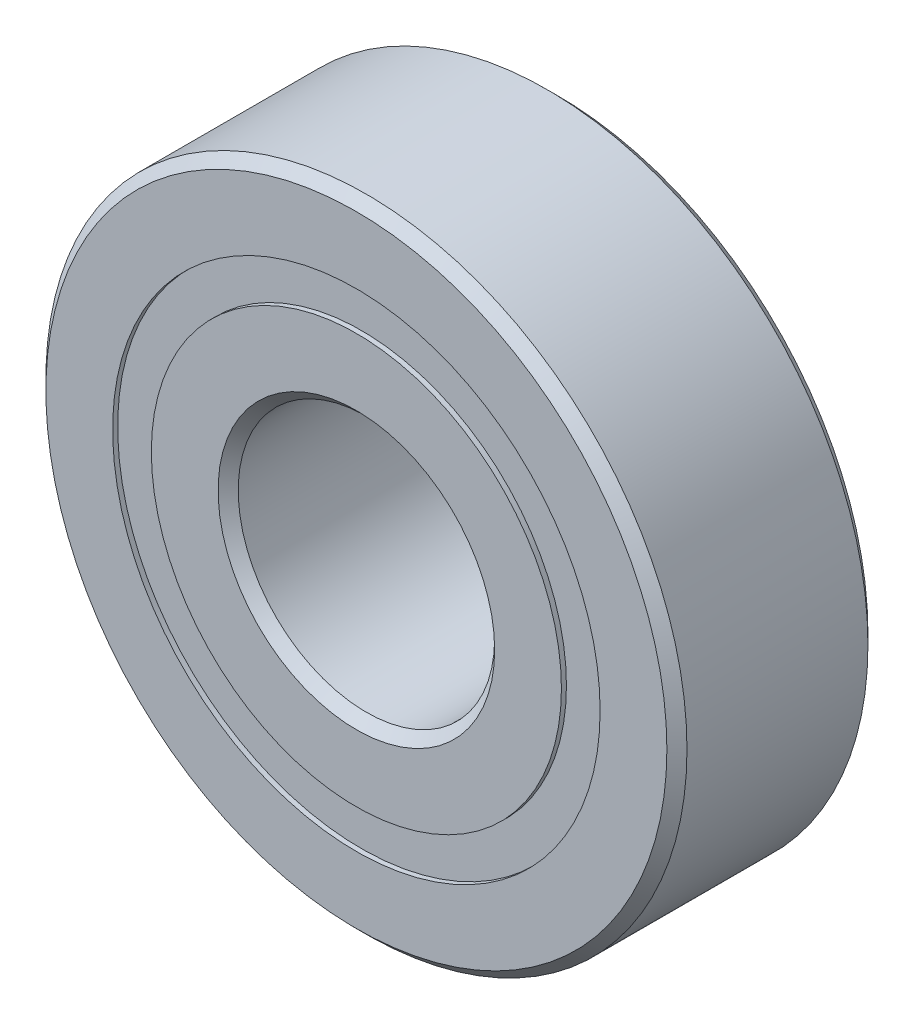
ISO-10303-21;
HEADER;
FILE_DESCRIPTION(('STEP AP214'),'2;1');
FILE_NAME('part.step','',(''),(''),'','','');
FILE_SCHEMA(('AUTOMOTIVE_DESIGN { 1 0 10303 214 1 1 1 1 }'));
ENDSEC;
DATA;
#1=APPLICATION_CONTEXT('core data for automotive mechanical design processes');
#2=APPLICATION_PROTOCOL_DEFINITION('international standard','automotive_design',2000,#1);
#3=PRODUCT_CONTEXT('',#1,'mechanical');
#4=PRODUCT('Part','Part','',(#3));
#5=PRODUCT_RELATED_PRODUCT_CATEGORY('part','',(#4));
#6=PRODUCT_DEFINITION_FORMATION('','',#4);
#7=PRODUCT_DEFINITION_CONTEXT('part definition',#1,'design');
#8=PRODUCT_DEFINITION('design','',#6,#7);
#9=PRODUCT_DEFINITION_SHAPE('','',#8);
#10=(LENGTH_UNIT() NAMED_UNIT(*) SI_UNIT(.MILLI.,.METRE.));
#11=(NAMED_UNIT(*) PLANE_ANGLE_UNIT() SI_UNIT($,.RADIAN.));
#12=(NAMED_UNIT(*) SI_UNIT($,.STERADIAN.) SOLID_ANGLE_UNIT());
#13=UNCERTAINTY_MEASURE_WITH_UNIT(LENGTH_MEASURE(1.E-05),#10,'distance_accuracy_value','');
#14=(GEOMETRIC_REPRESENTATION_CONTEXT(3) GLOBAL_UNCERTAINTY_ASSIGNED_CONTEXT((#13)) GLOBAL_UNIT_ASSIGNED_CONTEXT((#10,
#11,#12)) REPRESENTATION_CONTEXT('',''));
#15=CARTESIAN_POINT('',(0.,0.,0.));
#16=DIRECTION('',(0.,0.,1.));
#17=DIRECTION('',(1.,0.,0.));
#18=AXIS2_PLACEMENT_3D('',#15,#16,#17);
#19=CARTESIAN_POINT('',(0.,6.03522142857143,-2.36474));
#20=DIRECTION('',(0.,0.,1.));
#21=DIRECTION('',(1.,0.,0.));
#22=AXIS2_PLACEMENT_3D('',#19,#20,#21);
#23=PLANE('',#22);
#24=CARTESIAN_POINT('',(0.,0.,-2.36474));
#25=DIRECTION('',(0.,0.,1.));
#26=DIRECTION('',(1.,0.,0.));
#27=AXIS2_PLACEMENT_3D('',#24,#25,#26);
#28=CIRCLE('',#27,6.03522142857143);
#29=CARTESIAN_POINT('',(6.03522142857143,0.,-2.36474));
#30=VERTEX_POINT('',#29);
#31=EDGE_CURVE('E59',#30,#30,#28,.T.);
#32=ORIENTED_EDGE('',*,*,#31,.F.);
#33=EDGE_LOOP('',(#32));
#34=FACE_BOUND('',#33,.T.);
#35=CARTESIAN_POINT('',(0.,0.,-2.36474));
#36=DIRECTION('',(0.,0.,1.));
#37=DIRECTION('',(1.,0.,0.));
#38=AXIS2_PLACEMENT_3D('',#35,#36,#37);
#39=CIRCLE('',#38,5.07727857142857);
#40=CARTESIAN_POINT('',(5.07727857142857,0.,-2.36474));
#41=VERTEX_POINT('',#40);
#42=EDGE_CURVE('E11',#41,#41,#39,.T.);
#43=ORIENTED_EDGE('',*,*,#42,.T.);
#44=EDGE_LOOP('',(#43));
#45=FACE_BOUND('',#44,.T.);
#46=ADVANCED_FACE('F45',(#34,#45),#23,.F.);
#47=CARTESIAN_POINT('',(0.,0.,2.4892));
#48=DIRECTION('',(0.,0.,1.));
#49=DIRECTION('',(1.,0.,0.));
#50=AXIS2_PLACEMENT_3D('',#47,#48,#49);
#51=CYLINDRICAL_SURFACE('',#50,5.07727857142857);
#52=ORIENTED_EDGE('',*,*,#42,.F.);
#53=EDGE_LOOP('',(#52));
#54=FACE_BOUND('',#53,.T.);
#55=CARTESIAN_POINT('',(0.,0.,-1.20554465033679));
#56=DIRECTION('',(0.,0.,1.));
#57=DIRECTION('',(1.,0.,0.));
#58=AXIS2_PLACEMENT_3D('',#55,#56,#57);
#59=CIRCLE('',#58,5.07727857142857);
#60=CARTESIAN_POINT('',(5.07727857142857,0.,-1.20554465033679));
#61=VERTEX_POINT('',#60);
#62=EDGE_CURVE('E51',#61,#61,#59,.T.);
#63=ORIENTED_EDGE('',*,*,#62,.T.);
#64=EDGE_LOOP('',(#63));
#65=FACE_BOUND('',#64,.T.);
#66=ADVANCED_FACE('F68',(#54,#65),#51,.F.);
#67=CARTESIAN_POINT('',(0.,6.03522142857143,-1.20554465033679));
#68=DIRECTION('',(0.,0.,-1.));
#69=DIRECTION('',(-1.,0.,0.));
#70=AXIS2_PLACEMENT_3D('',#67,#68,#69);
#71=PLANE('',#70);
#72=ORIENTED_EDGE('',*,*,#62,.F.);
#73=EDGE_LOOP('',(#72));
#74=FACE_BOUND('',#73,.T.);
#75=CARTESIAN_POINT('',(0.,0.,-1.20554465033679));
#76=DIRECTION('',(0.,0.,1.));
#77=DIRECTION('',(1.,0.,0.));
#78=AXIS2_PLACEMENT_3D('',#75,#76,#77);
#79=CIRCLE('',#78,6.03522142857143);
#80=CARTESIAN_POINT('',(6.03522142857143,0.,-1.20554465033679));
#81=VERTEX_POINT('',#80);
#82=EDGE_CURVE('E55',#81,#81,#79,.T.);
#83=ORIENTED_EDGE('',*,*,#82,.T.);
#84=EDGE_LOOP('',(#83));
#85=FACE_BOUND('',#84,.T.);
#86=ADVANCED_FACE('F72',(#74,#85),#71,.F.);
#87=CARTESIAN_POINT('',(0.,0.,2.4892));
#88=DIRECTION('',(0.,0.,1.));
#89=DIRECTION('',(1.,0.,0.));
#90=AXIS2_PLACEMENT_3D('',#87,#88,#89);
#91=CYLINDRICAL_SURFACE('',#90,6.03522142857143);
#92=ORIENTED_EDGE('',*,*,#82,.F.);
#93=EDGE_LOOP('',(#92));
#94=FACE_BOUND('',#93,.T.);
#95=ORIENTED_EDGE('',*,*,#31,.T.);
#96=EDGE_LOOP('',(#95));
#97=FACE_BOUND('',#96,.T.);
#98=ADVANCED_FACE('F65',(#94,#97),#91,.T.);
#99=CLOSED_SHELL('',(#46,#66,#86,#98));
#100=MANIFOLD_SOLID_BREP('B2',#99);
#101=CARTESIAN_POINT('',(0.,6.03522142857143,2.36474));
#102=DIRECTION('',(0.,0.,-1.));
#103=DIRECTION('',(-1.,0.,0.));
#104=AXIS2_PLACEMENT_3D('',#101,#102,#103);
#105=PLANE('',#104);
#106=CARTESIAN_POINT('',(0.,0.,2.36474));
#107=DIRECTION('',(0.,0.,1.));
#108=DIRECTION('',(1.,0.,0.));
#109=AXIS2_PLACEMENT_3D('',#106,#107,#108);
#110=CIRCLE('',#109,5.07727857142857);
#111=CARTESIAN_POINT('',(5.07727857142857,0.,2.36474));
#112=VERTEX_POINT('',#111);
#113=EDGE_CURVE('E44',#112,#112,#110,.T.);
#114=ORIENTED_EDGE('',*,*,#113,.F.);
#115=EDGE_LOOP('',(#114));
#116=FACE_BOUND('',#115,.T.);
#117=CARTESIAN_POINT('',(0.,0.,2.36474));
#118=DIRECTION('',(0.,0.,1.));
#119=DIRECTION('',(1.,0.,0.));
#120=AXIS2_PLACEMENT_3D('',#117,#118,#119);
#121=CIRCLE('',#120,6.03522142857143);
#122=CARTESIAN_POINT('',(6.03522142857143,0.,2.36474));
#123=VERTEX_POINT('',#122);
#124=EDGE_CURVE('E126',#123,#123,#121,.T.);
#125=ORIENTED_EDGE('',*,*,#124,.T.);
#126=EDGE_LOOP('',(#125));
#127=FACE_BOUND('',#126,.T.);
#128=ADVANCED_FACE('F112',(#116,#127),#105,.F.);
#129=CARTESIAN_POINT('',(0.,0.,2.4892));
#130=DIRECTION('',(0.,0.,1.));
#131=DIRECTION('',(1.,0.,0.));
#132=AXIS2_PLACEMENT_3D('',#129,#130,#131);
#133=CYLINDRICAL_SURFACE('',#132,5.07727857142857);
#134=CARTESIAN_POINT('',(0.,0.,1.20554465033679));
#135=DIRECTION('',(0.,0.,1.));
#136=DIRECTION('',(1.,0.,0.));
#137=AXIS2_PLACEMENT_3D('',#134,#135,#136);
#138=CIRCLE('',#137,5.07727857142857);
#139=CARTESIAN_POINT('',(5.07727857142857,0.,1.20554465033679));
#140=VERTEX_POINT('',#139);
#141=EDGE_CURVE('E118',#140,#140,#138,.T.);
#142=ORIENTED_EDGE('',*,*,#141,.F.);
#143=EDGE_LOOP('',(#142));
#144=FACE_BOUND('',#143,.T.);
#145=ORIENTED_EDGE('',*,*,#113,.T.);
#146=EDGE_LOOP('',(#145));
#147=FACE_BOUND('',#146,.T.);
#148=ADVANCED_FACE('F141',(#144,#147),#133,.F.);
#149=CARTESIAN_POINT('',(0.,6.03522142857143,1.20554465033679));
#150=DIRECTION('',(0.,0.,1.));
#151=DIRECTION('',(1.,0.,0.));
#152=AXIS2_PLACEMENT_3D('',#149,#150,#151);
#153=PLANE('',#152);
#154=CARTESIAN_POINT('',(0.,0.,1.20554465033679));
#155=DIRECTION('',(0.,0.,1.));
#156=DIRECTION('',(1.,0.,0.));
#157=AXIS2_PLACEMENT_3D('',#154,#155,#156);
#158=CIRCLE('',#157,6.03522142857143);
#159=CARTESIAN_POINT('',(6.03522142857143,0.,1.20554465033679));
#160=VERTEX_POINT('',#159);
#161=EDGE_CURVE('E122',#160,#160,#158,.T.);
#162=ORIENTED_EDGE('',*,*,#161,.F.);
#163=EDGE_LOOP('',(#162));
#164=FACE_BOUND('',#163,.T.);
#165=ORIENTED_EDGE('',*,*,#141,.T.);
#166=EDGE_LOOP('',(#165));
#167=FACE_BOUND('',#166,.T.);
#168=ADVANCED_FACE('F136',(#164,#167),#153,.F.);
#169=CARTESIAN_POINT('',(0.,0.,2.4892));
#170=DIRECTION('',(0.,0.,1.));
#171=DIRECTION('',(1.,0.,0.));
#172=AXIS2_PLACEMENT_3D('',#169,#170,#171);
#173=CYLINDRICAL_SURFACE('',#172,6.03522142857143);
#174=ORIENTED_EDGE('',*,*,#124,.F.);
#175=EDGE_LOOP('',(#174));
#176=FACE_BOUND('',#175,.T.);
#177=ORIENTED_EDGE('',*,*,#161,.T.);
#178=EDGE_LOOP('',(#177));
#179=FACE_BOUND('',#178,.T.);
#180=ADVANCED_FACE('F133',(#176,#179),#173,.T.);
#181=CLOSED_SHELL('',(#128,#148,#168,#180));
#182=MANIFOLD_SOLID_BREP('B6',#181);
#183=CARTESIAN_POINT('',(-3.92886205296771,3.9288620529678,0.));
#184=DIRECTION('',(0.,0.,1.));
#185=DIRECTION('',(-0.707106781186539,0.707106781186556,0.));
#186=AXIS2_PLACEMENT_3D('',#183,#184,#185);
#187=SPHERICAL_SURFACE('',#186,1.20554465033679);
#188=CARTESIAN_POINT('',(-3.92886205296771,3.9288620529678,1.20554465033679));
#189=VERTEX_POINT('',#188);
#190=VERTEX_LOOP('',#189);
#191=FACE_BOUND('',#190,.T.);
#192=ADVANCED_FACE('F179',(#191),#187,.T.);
#193=CLOSED_SHELL('',(#192));
#194=MANIFOLD_SOLID_BREP('B39',#193);
#195=CARTESIAN_POINT('',(-5.55625,0.,0.));
#196=DIRECTION('',(0.,0.,1.));
#197=DIRECTION('',(-1.,0.,0.));
#198=AXIS2_PLACEMENT_3D('',#195,#196,#197);
#199=SPHERICAL_SURFACE('',#198,1.20554465033679);
#200=CARTESIAN_POINT('',(-5.55625,0.,1.20554465033679));
#201=VERTEX_POINT('',#200);
#202=VERTEX_LOOP('',#201);
#203=FACE_BOUND('',#202,.T.);
#204=ADVANCED_FACE('F199',(#203),#199,.T.);
#205=CLOSED_SHELL('',(#204));
#206=MANIFOLD_SOLID_BREP('B108',#205);
#207=CARTESIAN_POINT('',(-3.92886205296779,-3.92886205296772,0.));
#208=DIRECTION('',(0.,0.,1.));
#209=DIRECTION('',(-0.707106781186554,-0.707106781186541,0.));
#210=AXIS2_PLACEMENT_3D('',#207,#208,#209);
#211=SPHERICAL_SURFACE('',#210,1.20554465033679);
#212=CARTESIAN_POINT('',(-3.92886205296779,-3.92886205296772,1.20554465033679));
#213=VERTEX_POINT('',#212);
#214=VERTEX_LOOP('',#213);
#215=FACE_BOUND('',#214,.T.);
#216=ADVANCED_FACE('F219',(#215),#211,.T.);
#217=CLOSED_SHELL('',(#216));
#218=MANIFOLD_SOLID_BREP('B175',#217);
#219=CARTESIAN_POINT('',(0.,-5.55625,0.));
#220=DIRECTION('',(0.,0.,1.));
#221=DIRECTION('',(0.,-1.,0.));
#222=AXIS2_PLACEMENT_3D('',#219,#220,#221);
#223=SPHERICAL_SURFACE('',#222,1.20554465033679);
#224=CARTESIAN_POINT('',(0.,-5.55625,1.20554465033679));
#225=VERTEX_POINT('',#224);
#226=VERTEX_LOOP('',#225);
#227=FACE_BOUND('',#226,.T.);
#228=ADVANCED_FACE('F239',(#227),#223,.T.);
#229=CLOSED_SHELL('',(#228));
#230=MANIFOLD_SOLID_BREP('B195',#229);
#231=CARTESIAN_POINT('',(3.92886205296773,-3.92886205296778,0.));
#232=DIRECTION('',(0.,0.,1.));
#233=DIRECTION('',(0.707106781186544,-0.707106781186551,0.));
#234=AXIS2_PLACEMENT_3D('',#231,#232,#233);
#235=SPHERICAL_SURFACE('',#234,1.20554465033679);
#236=CARTESIAN_POINT('',(3.92886205296773,-3.92886205296778,1.20554465033679));
#237=VERTEX_POINT('',#236);
#238=VERTEX_LOOP('',#237);
#239=FACE_BOUND('',#238,.T.);
#240=ADVANCED_FACE('F259',(#239),#235,.T.);
#241=CLOSED_SHELL('',(#240));
#242=MANIFOLD_SOLID_BREP('B215',#241);
#243=CARTESIAN_POINT('',(5.55625,0.,0.));
#244=DIRECTION('',(0.,0.,1.));
#245=DIRECTION('',(1.,0.,0.));
#246=AXIS2_PLACEMENT_3D('',#243,#244,#245);
#247=SPHERICAL_SURFACE('',#246,1.20554465033679);
#248=CARTESIAN_POINT('',(5.55625,0.,1.20554465033679));
#249=VERTEX_POINT('',#248);
#250=VERTEX_LOOP('',#249);
#251=FACE_BOUND('',#250,.T.);
#252=ADVANCED_FACE('F279',(#251),#247,.T.);
#253=CLOSED_SHELL('',(#252));
#254=MANIFOLD_SOLID_BREP('B235',#253);
#255=CARTESIAN_POINT('',(3.92886205296776,3.92886205296775,0.));
#256=DIRECTION('',(0.,0.,1.));
#257=DIRECTION('',(0.707106781186549,0.707106781186546,0.));
#258=AXIS2_PLACEMENT_3D('',#255,#256,#257);
#259=SPHERICAL_SURFACE('',#258,1.20554465033679);
#260=CARTESIAN_POINT('',(3.92886205296776,3.92886205296775,1.20554465033679));
#261=VERTEX_POINT('',#260);
#262=VERTEX_LOOP('',#261);
#263=FACE_BOUND('',#262,.T.);
#264=ADVANCED_FACE('F299',(#263),#259,.T.);
#265=CLOSED_SHELL('',(#264));
#266=MANIFOLD_SOLID_BREP('B255',#265);
#267=CARTESIAN_POINT('',(0.,5.55625,0.));
#268=DIRECTION('',(0.,0.,1.));
#269=DIRECTION('',(0.,1.,0.));
#270=AXIS2_PLACEMENT_3D('',#267,#268,#269);
#271=SPHERICAL_SURFACE('',#270,1.20554465033679);
#272=CARTESIAN_POINT('',(0.,5.55625,1.20554465033679));
#273=VERTEX_POINT('',#272);
#274=VERTEX_LOOP('',#273);
#275=FACE_BOUND('',#274,.T.);
#276=ADVANCED_FACE('F321',(#275),#271,.T.);
#277=CLOSED_SHELL('',(#276));
#278=MANIFOLD_SOLID_BREP('B275',#277);
#279=CARTESIAN_POINT('',(0.,5.07727857142857,2.4892));
#280=DIRECTION('',(0.,0.,-1.));
#281=DIRECTION('',(-1.,0.,0.));
#282=AXIS2_PLACEMENT_3D('',#279,#280,#281);
#283=PLANE('',#282);
#284=CARTESIAN_POINT('',(0.,0.,2.4892));
#285=DIRECTION('',(0.,0.,1.));
#286=DIRECTION('',(1.,0.,0.));
#287=AXIS2_PLACEMENT_3D('',#284,#285,#286);
#288=CIRCLE('',#287,3.42392);
#289=CARTESIAN_POINT('',(3.42392,0.,2.4892));
#290=VERTEX_POINT('',#289);
#291=EDGE_CURVE('E368',#290,#290,#288,.T.);
#292=ORIENTED_EDGE('',*,*,#291,.F.);
#293=EDGE_LOOP('',(#292));
#294=FACE_BOUND('',#293,.T.);
#295=CARTESIAN_POINT('',(0.,0.,2.4892));
#296=DIRECTION('',(0.,0.,1.));
#297=DIRECTION('',(1.,0.,0.));
#298=AXIS2_PLACEMENT_3D('',#295,#296,#297);
#299=CIRCLE('',#298,5.07727857142857);
#300=CARTESIAN_POINT('',(5.07727857142857,0.,2.4892));
#301=VERTEX_POINT('',#300);
#302=EDGE_CURVE('E320',#301,#301,#299,.T.);
#303=ORIENTED_EDGE('',*,*,#302,.T.);
#304=EDGE_LOOP('',(#303));
#305=FACE_BOUND('',#304,.T.);
#306=ADVANCED_FACE('F340',(#294,#305),#283,.F.);
#307=CARTESIAN_POINT('',(0.,0.,2.4892));
#308=DIRECTION('',(0.,0.,1.));
#309=DIRECTION('',(1.,0.,0.));
#310=AXIS2_PLACEMENT_3D('',#307,#308,#309);
#311=CYLINDRICAL_SURFACE('',#310,5.07727857142857);
#312=ORIENTED_EDGE('',*,*,#302,.F.);
#313=EDGE_LOOP('',(#312));
#314=FACE_BOUND('',#313,.T.);
#315=CARTESIAN_POINT('',(0.,0.,1.10631111111111));
#316=DIRECTION('',(0.,0.,1.));
#317=DIRECTION('',(1.,0.,0.));
#318=AXIS2_PLACEMENT_3D('',#315,#316,#317);
#319=CIRCLE('',#318,5.07727857142857);
#320=CARTESIAN_POINT('',(5.07727857142857,0.,1.10631111111111));
#321=VERTEX_POINT('',#320);
#322=EDGE_CURVE('E346',#321,#321,#319,.T.);
#323=ORIENTED_EDGE('',*,*,#322,.T.);
#324=EDGE_LOOP('',(#323));
#325=FACE_BOUND('',#324,.T.);
#326=ADVANCED_FACE('F375',(#314,#325),#311,.T.);
#327=CARTESIAN_POINT('',(0.,0.,0.));
#328=DIRECTION('',(0.,0.,1.));
#329=DIRECTION('',(1.,0.,0.));
#330=AXIS2_PLACEMENT_3D('',#327,#328,#329);
#331=TOROIDAL_SURFACE('',#330,5.55625,1.20554465033679);
#332=ORIENTED_EDGE('',*,*,#322,.F.);
#333=EDGE_LOOP('',(#332));
#334=FACE_BOUND('',#333,.T.);
#335=CARTESIAN_POINT('',(0.,0.,-1.10631111111111));
#336=DIRECTION('',(0.,0.,1.));
#337=DIRECTION('',(1.,0.,0.));
#338=AXIS2_PLACEMENT_3D('',#335,#336,#337);
#339=CIRCLE('',#338,5.07727857142857);
#340=CARTESIAN_POINT('',(5.07727857142857,0.,-1.10631111111111));
#341=VERTEX_POINT('',#340);
#342=EDGE_CURVE('E350',#341,#341,#339,.T.);
#343=ORIENTED_EDGE('',*,*,#342,.T.);
#344=EDGE_LOOP('',(#343));
#345=FACE_BOUND('',#344,.T.);
#346=ADVANCED_FACE('F379',(#334,#345),#331,.F.);
#347=CARTESIAN_POINT('',(0.,0.,2.4892));
#348=DIRECTION('',(0.,0.,1.));
#349=DIRECTION('',(1.,0.,0.));
#350=AXIS2_PLACEMENT_3D('',#347,#348,#349);
#351=CYLINDRICAL_SURFACE('',#350,5.07727857142857);
#352=ORIENTED_EDGE('',*,*,#342,.F.);
#353=EDGE_LOOP('',(#352));
#354=FACE_BOUND('',#353,.T.);
#355=CARTESIAN_POINT('',(0.,0.,-2.4892));
#356=DIRECTION('',(0.,0.,1.));
#357=DIRECTION('',(1.,0.,0.));
#358=AXIS2_PLACEMENT_3D('',#355,#356,#357);
#359=CIRCLE('',#358,5.07727857142857);
#360=CARTESIAN_POINT('',(5.07727857142857,0.,-2.4892));
#361=VERTEX_POINT('',#360);
#362=EDGE_CURVE('E354',#361,#361,#359,.T.);
#363=ORIENTED_EDGE('',*,*,#362,.T.);
#364=EDGE_LOOP('',(#363));
#365=FACE_BOUND('',#364,.T.);
#366=ADVANCED_FACE('F384',(#354,#365),#351,.T.);
#367=CARTESIAN_POINT('',(0.,3.42392,-2.4892));
#368=DIRECTION('',(0.,0.,1.));
#369=DIRECTION('',(1.,0.,0.));
#370=AXIS2_PLACEMENT_3D('',#367,#368,#369);
#371=PLANE('',#370);
#372=ORIENTED_EDGE('',*,*,#362,.F.);
#373=EDGE_LOOP('',(#372));
#374=FACE_BOUND('',#373,.T.);
#375=CARTESIAN_POINT('',(0.,0.,-2.4892));
#376=DIRECTION('',(0.,0.,1.));
#377=DIRECTION('',(1.,0.,0.));
#378=AXIS2_PLACEMENT_3D('',#375,#376,#377);
#379=CIRCLE('',#378,3.42392);
#380=CARTESIAN_POINT('',(3.42392,0.,-2.4892));
#381=VERTEX_POINT('',#380);
#382=EDGE_CURVE('E359',#381,#381,#379,.T.);
#383=ORIENTED_EDGE('',*,*,#382,.T.);
#384=EDGE_LOOP('',(#383));
#385=FACE_BOUND('',#384,.T.);
#386=ADVANCED_FACE('F390',(#374,#385),#371,.F.);
#387=CARTESIAN_POINT('',(0.,0.,-2.24028));
#388=DIRECTION('',(0.,0.,-1.));
#389=DIRECTION('',(-1.,0.,0.));
#390=AXIS2_PLACEMENT_3D('',#387,#388,#389);
#391=CONICAL_SURFACE('',#390,3.175,0.78539816339744);
#392=ORIENTED_EDGE('',*,*,#382,.F.);
#393=EDGE_LOOP('',(#392));
#394=FACE_BOUND('',#393,.T.);
#395=CARTESIAN_POINT('',(0.,0.,-2.24028));
#396=DIRECTION('',(0.,0.,1.));
#397=DIRECTION('',(1.,0.,0.));
#398=AXIS2_PLACEMENT_3D('',#395,#396,#397);
#399=CIRCLE('',#398,3.175);
#400=CARTESIAN_POINT('',(3.175,0.,-2.24028));
#401=VERTEX_POINT('',#400);
#402=EDGE_CURVE('E362',#401,#401,#399,.T.);
#403=ORIENTED_EDGE('',*,*,#402,.T.);
#404=EDGE_LOOP('',(#403));
#405=FACE_BOUND('',#404,.T.);
#406=ADVANCED_FACE('F394',(#394,#405),#391,.F.);
#407=CARTESIAN_POINT('',(0.,0.,2.4892));
#408=DIRECTION('',(0.,0.,1.));
#409=DIRECTION('',(1.,0.,0.));
#410=AXIS2_PLACEMENT_3D('',#407,#408,#409);
#411=CYLINDRICAL_SURFACE('',#410,3.175);
#412=ORIENTED_EDGE('',*,*,#402,.F.);
#413=EDGE_LOOP('',(#412));
#414=FACE_BOUND('',#413,.T.);
#415=CARTESIAN_POINT('',(0.,0.,2.24028));
#416=DIRECTION('',(0.,0.,1.));
#417=DIRECTION('',(1.,0.,0.));
#418=AXIS2_PLACEMENT_3D('',#415,#416,#417);
#419=CIRCLE('',#418,3.175);
#420=CARTESIAN_POINT('',(3.175,0.,2.24028));
#421=VERTEX_POINT('',#420);
#422=EDGE_CURVE('E365',#421,#421,#419,.T.);
#423=ORIENTED_EDGE('',*,*,#422,.T.);
#424=EDGE_LOOP('',(#423));
#425=FACE_BOUND('',#424,.T.);
#426=ADVANCED_FACE('F398',(#414,#425),#411,.F.);
#427=CARTESIAN_POINT('',(0.,0.,2.4892));
#428=DIRECTION('',(0.,0.,1.));
#429=DIRECTION('',(1.,0.,0.));
#430=AXIS2_PLACEMENT_3D('',#427,#428,#429);
#431=CONICAL_SURFACE('',#430,3.42392,0.785398163397456);
#432=ORIENTED_EDGE('',*,*,#422,.F.);
#433=EDGE_LOOP('',(#432));
#434=FACE_BOUND('',#433,.T.);
#435=ORIENTED_EDGE('',*,*,#291,.T.);
#436=EDGE_LOOP('',(#435));
#437=FACE_BOUND('',#436,.T.);
#438=ADVANCED_FACE('F372',(#434,#437),#431,.F.);
#439=CLOSED_SHELL('',(#306,#326,#346,#366,#386,#406,#426,#438));
#440=MANIFOLD_SOLID_BREP('B295',#439);
#441=CARTESIAN_POINT('',(0.,0.,2.24028));
#442=DIRECTION('',(0.,0.,-1.));
#443=DIRECTION('',(-1.,0.,0.));
#444=AXIS2_PLACEMENT_3D('',#441,#442,#443);
#445=CONICAL_SURFACE('',#444,7.9375,0.785398163397445);
#446=CARTESIAN_POINT('',(0.,0.,2.4892));
#447=DIRECTION('',(0.,0.,1.));
#448=DIRECTION('',(1.,0.,0.));
#449=AXIS2_PLACEMENT_3D('',#446,#447,#448);
#450=CIRCLE('',#449,7.68858);
#451=CARTESIAN_POINT('',(7.68858,0.,2.4892));
#452=VERTEX_POINT('',#451);
#453=EDGE_CURVE('E489',#452,#452,#450,.T.);
#454=ORIENTED_EDGE('',*,*,#453,.F.);
#455=EDGE_LOOP('',(#454));
#456=FACE_BOUND('',#455,.T.);
#457=CARTESIAN_POINT('',(0.,0.,2.24028));
#458=DIRECTION('',(0.,0.,1.));
#459=DIRECTION('',(1.,0.,0.));
#460=AXIS2_PLACEMENT_3D('',#457,#458,#459);
#461=CIRCLE('',#460,7.9375);
#462=CARTESIAN_POINT('',(7.9375,0.,2.24028));
#463=VERTEX_POINT('',#462);
#464=EDGE_CURVE('E339',#463,#463,#461,.T.);
#465=ORIENTED_EDGE('',*,*,#464,.T.);
#466=EDGE_LOOP('',(#465));
#467=FACE_BOUND('',#466,.T.);
#468=ADVANCED_FACE('F461',(#456,#467),#445,.T.);
#469=CARTESIAN_POINT('',(0.,0.,2.4892));
#470=DIRECTION('',(0.,0.,1.));
#471=DIRECTION('',(1.,0.,0.));
#472=AXIS2_PLACEMENT_3D('',#469,#470,#471);
#473=CYLINDRICAL_SURFACE('',#472,7.9375);
#474=ORIENTED_EDGE('',*,*,#464,.F.);
#475=EDGE_LOOP('',(#474));
#476=FACE_BOUND('',#475,.T.);
#477=CARTESIAN_POINT('',(0.,0.,-2.24028));
#478=DIRECTION('',(0.,0.,1.));
#479=DIRECTION('',(1.,0.,0.));
#480=AXIS2_PLACEMENT_3D('',#477,#478,#479);
#481=CIRCLE('',#480,7.9375);
#482=CARTESIAN_POINT('',(7.9375,0.,-2.24028));
#483=VERTEX_POINT('',#482);
#484=EDGE_CURVE('E467',#483,#483,#481,.T.);
#485=ORIENTED_EDGE('',*,*,#484,.T.);
#486=EDGE_LOOP('',(#485));
#487=FACE_BOUND('',#486,.T.);
#488=ADVANCED_FACE('F496',(#476,#487),#473,.T.);
#489=CARTESIAN_POINT('',(0.,0.,-2.4892));
#490=DIRECTION('',(0.,0.,1.));
#491=DIRECTION('',(1.,0.,0.));
#492=AXIS2_PLACEMENT_3D('',#489,#490,#491);
#493=CONICAL_SURFACE('',#492,7.68858,0.785398163397443);
#494=ORIENTED_EDGE('',*,*,#484,.F.);
#495=EDGE_LOOP('',(#494));
#496=FACE_BOUND('',#495,.T.);
#497=CARTESIAN_POINT('',(0.,0.,-2.4892));
#498=DIRECTION('',(0.,0.,1.));
#499=DIRECTION('',(1.,0.,0.));
#500=AXIS2_PLACEMENT_3D('',#497,#498,#499);
#501=CIRCLE('',#500,7.68858);
#502=CARTESIAN_POINT('',(7.68858,0.,-2.4892));
#503=VERTEX_POINT('',#502);
#504=EDGE_CURVE('E471',#503,#503,#501,.T.);
#505=ORIENTED_EDGE('',*,*,#504,.T.);
#506=EDGE_LOOP('',(#505));
#507=FACE_BOUND('',#506,.T.);
#508=ADVANCED_FACE('F500',(#496,#507),#493,.T.);
#509=CARTESIAN_POINT('',(0.,7.68858,-2.4892));
#510=DIRECTION('',(0.,0.,1.));
#511=DIRECTION('',(1.,0.,0.));
#512=AXIS2_PLACEMENT_3D('',#509,#510,#511);
#513=PLANE('',#512);
#514=ORIENTED_EDGE('',*,*,#504,.F.);
#515=EDGE_LOOP('',(#514));
#516=FACE_BOUND('',#515,.T.);
#517=CARTESIAN_POINT('',(0.,0.,-2.4892));
#518=DIRECTION('',(0.,0.,1.));
#519=DIRECTION('',(1.,0.,0.));
#520=AXIS2_PLACEMENT_3D('',#517,#518,#519);
#521=CIRCLE('',#520,6.03522142857143);
#522=CARTESIAN_POINT('',(6.03522142857143,0.,-2.4892));
#523=VERTEX_POINT('',#522);
#524=EDGE_CURVE('E475',#523,#523,#521,.T.);
#525=ORIENTED_EDGE('',*,*,#524,.T.);
#526=EDGE_LOOP('',(#525));
#527=FACE_BOUND('',#526,.T.);
#528=ADVANCED_FACE('F505',(#516,#527),#513,.F.);
#529=CARTESIAN_POINT('',(0.,0.,2.4892));
#530=DIRECTION('',(0.,0.,1.));
#531=DIRECTION('',(1.,0.,0.));
#532=AXIS2_PLACEMENT_3D('',#529,#530,#531);
#533=CYLINDRICAL_SURFACE('',#532,6.03522142857143);
#534=ORIENTED_EDGE('',*,*,#524,.F.);
#535=EDGE_LOOP('',(#534));
#536=FACE_BOUND('',#535,.T.);
#537=CARTESIAN_POINT('',(0.,0.,-1.10631111111111));
#538=DIRECTION('',(0.,0.,1.));
#539=DIRECTION('',(1.,0.,0.));
#540=AXIS2_PLACEMENT_3D('',#537,#538,#539);
#541=CIRCLE('',#540,6.03522142857143);
#542=CARTESIAN_POINT('',(6.03522142857143,0.,-1.10631111111111));
#543=VERTEX_POINT('',#542);
#544=EDGE_CURVE('E480',#543,#543,#541,.T.);
#545=ORIENTED_EDGE('',*,*,#544,.T.);
#546=EDGE_LOOP('',(#545));
#547=FACE_BOUND('',#546,.T.);
#548=ADVANCED_FACE('F511',(#536,#547),#533,.F.);
#549=CARTESIAN_POINT('',(0.,0.,0.));
#550=DIRECTION('',(0.,0.,1.));
#551=DIRECTION('',(1.,0.,0.));
#552=AXIS2_PLACEMENT_3D('',#549,#550,#551);
#553=TOROIDAL_SURFACE('',#552,5.55625,1.20554465033679);
#554=ORIENTED_EDGE('',*,*,#544,.F.);
#555=EDGE_LOOP('',(#554));
#556=FACE_BOUND('',#555,.T.);
#557=CARTESIAN_POINT('',(0.,0.,1.10631111111111));
#558=DIRECTION('',(0.,0.,1.));
#559=DIRECTION('',(1.,0.,0.));
#560=AXIS2_PLACEMENT_3D('',#557,#558,#559);
#561=CIRCLE('',#560,6.03522142857143);
#562=CARTESIAN_POINT('',(6.03522142857143,0.,1.10631111111111));
#563=VERTEX_POINT('',#562);
#564=EDGE_CURVE('E483',#563,#563,#561,.T.);
#565=ORIENTED_EDGE('',*,*,#564,.T.);
#566=EDGE_LOOP('',(#565));
#567=FACE_BOUND('',#566,.T.);
#568=ADVANCED_FACE('F515',(#556,#567),#553,.F.);
#569=CARTESIAN_POINT('',(0.,0.,2.4892));
#570=DIRECTION('',(0.,0.,1.));
#571=DIRECTION('',(1.,0.,0.));
#572=AXIS2_PLACEMENT_3D('',#569,#570,#571);
#573=CYLINDRICAL_SURFACE('',#572,6.03522142857143);
#574=ORIENTED_EDGE('',*,*,#564,.F.);
#575=EDGE_LOOP('',(#574));
#576=FACE_BOUND('',#575,.T.);
#577=CARTESIAN_POINT('',(0.,0.,2.4892));
#578=DIRECTION('',(0.,0.,1.));
#579=DIRECTION('',(1.,0.,0.));
#580=AXIS2_PLACEMENT_3D('',#577,#578,#579);
#581=CIRCLE('',#580,6.03522142857143);
#582=CARTESIAN_POINT('',(6.03522142857143,0.,2.4892));
#583=VERTEX_POINT('',#582);
#584=EDGE_CURVE('E486',#583,#583,#581,.T.);
#585=ORIENTED_EDGE('',*,*,#584,.T.);
#586=EDGE_LOOP('',(#585));
#587=FACE_BOUND('',#586,.T.);
#588=ADVANCED_FACE('F519',(#576,#587),#573,.F.);
#589=CARTESIAN_POINT('',(0.,7.68858,2.4892));
#590=DIRECTION('',(0.,0.,-1.));
#591=DIRECTION('',(-1.,0.,0.));
#592=AXIS2_PLACEMENT_3D('',#589,#590,#591);
#593=PLANE('',#592);
#594=ORIENTED_EDGE('',*,*,#584,.F.);
#595=EDGE_LOOP('',(#594));
#596=FACE_BOUND('',#595,.T.);
#597=ORIENTED_EDGE('',*,*,#453,.T.);
#598=EDGE_LOOP('',(#597));
#599=FACE_BOUND('',#598,.T.);
#600=ADVANCED_FACE('F493',(#596,#599),#593,.F.);
#601=CLOSED_SHELL('',(#468,#488,#508,#528,#548,#568,#588,#600));
#602=MANIFOLD_SOLID_BREP('B315',#601);
#603=ADVANCED_BREP_SHAPE_REPRESENTATION('',(#18,#100,#182,#194,#206,#218,#230,#242,#254,#266,
#278,#440,#602),#14);
#604=SHAPE_DEFINITION_REPRESENTATION(#9,#603);
ENDSEC;
END-ISO-10303-21;
